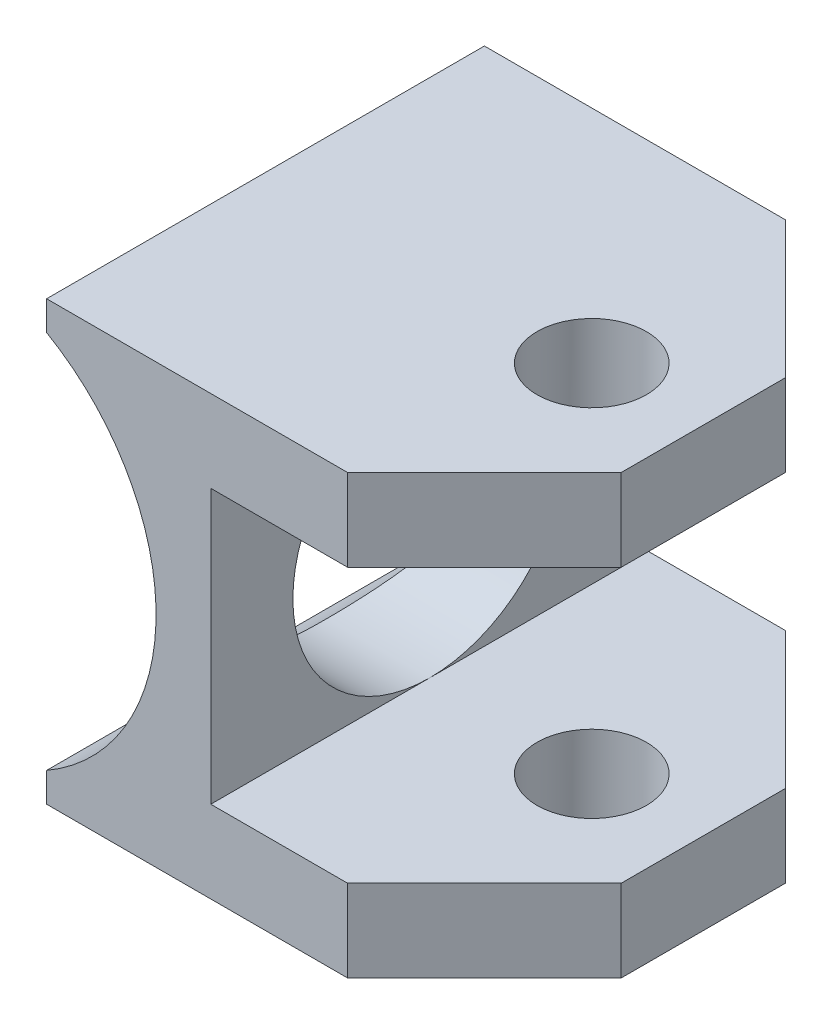
ISO-10303-21;
HEADER;
FILE_DESCRIPTION(('STEP AP214'),'2;1');
FILE_NAME('part.step','',(''),(''),'','','');
FILE_SCHEMA(('AUTOMOTIVE_DESIGN { 1 0 10303 214 1 1 1 1 }'));
ENDSEC;
DATA;
#1=APPLICATION_CONTEXT('core data for automotive mechanical design processes');
#2=APPLICATION_PROTOCOL_DEFINITION('international standard','automotive_design',2000,#1);
#3=PRODUCT_CONTEXT('',#1,'mechanical');
#4=PRODUCT('Part','Part','',(#3));
#5=PRODUCT_RELATED_PRODUCT_CATEGORY('part','',(#4));
#6=PRODUCT_DEFINITION_FORMATION('','',#4);
#7=PRODUCT_DEFINITION_CONTEXT('part definition',#1,'design');
#8=PRODUCT_DEFINITION('design','',#6,#7);
#9=PRODUCT_DEFINITION_SHAPE('','',#8);
#10=(LENGTH_UNIT() NAMED_UNIT(*) SI_UNIT(.MILLI.,.METRE.));
#11=(NAMED_UNIT(*) PLANE_ANGLE_UNIT() SI_UNIT($,.RADIAN.));
#12=(NAMED_UNIT(*) SI_UNIT($,.STERADIAN.) SOLID_ANGLE_UNIT());
#13=UNCERTAINTY_MEASURE_WITH_UNIT(LENGTH_MEASURE(1.E-05),#10,'distance_accuracy_value','');
#14=(GEOMETRIC_REPRESENTATION_CONTEXT(3) GLOBAL_UNCERTAINTY_ASSIGNED_CONTEXT((#13)) GLOBAL_UNIT_ASSIGNED_CONTEXT((#10,
#11,#12)) REPRESENTATION_CONTEXT('',''));
#15=CARTESIAN_POINT('',(0.,0.,0.));
#16=DIRECTION('',(0.,0.,1.));
#17=DIRECTION('',(1.,0.,0.));
#18=AXIS2_PLACEMENT_3D('',#15,#16,#17);
#19=CARTESIAN_POINT('',(15.875,7.9375,25.4));
#20=DIRECTION('',(-1.,0.,0.));
#21=DIRECTION('',(0.,-1.,0.));
#22=AXIS2_PLACEMENT_3D('',#19,#20,#21);
#23=PLANE('',#22);
#24=DIRECTION('',(0.,0.,-1.));
#25=VECTOR('',#24,1.);
#26=CARTESIAN_POINT('',(15.875,-7.9375,25.4));
#27=LINE('',#26,#25);
#28=CARTESIAN_POINT('',(15.875,-7.9375,25.4));
#29=VERTEX_POINT('',#28);
#30=CARTESIAN_POINT('',(15.875,-7.9375,12.7));
#31=VERTEX_POINT('',#30);
#32=EDGE_CURVE('E163',#29,#31,#27,.T.);
#33=ORIENTED_EDGE('',*,*,#32,.T.);
#34=CARTESIAN_POINT('',(15.875,0.,12.7));
#35=DIRECTION('',(1.,0.,0.));
#36=DIRECTION('',(0.,1.,0.));
#37=AXIS2_PLACEMENT_3D('',#34,#35,#36);
#38=CIRCLE('',#37,7.9375);
#39=CARTESIAN_POINT('',(15.875,7.9375,12.7));
#40=VERTEX_POINT('',#39);
#41=EDGE_CURVE('E56',#40,#31,#38,.T.);
#42=ORIENTED_EDGE('',*,*,#41,.F.);
#43=DIRECTION('',(0.,0.,-1.));
#44=VECTOR('',#43,1.);
#45=CARTESIAN_POINT('',(15.875,7.9375,25.4));
#46=LINE('',#45,#44);
#47=CARTESIAN_POINT('',(15.875,7.9375,25.4));
#48=VERTEX_POINT('',#47);
#49=EDGE_CURVE('E160',#48,#40,#46,.T.);
#50=ORIENTED_EDGE('',*,*,#49,.F.);
#51=DIRECTION('',(0.,1.,0.));
#52=VECTOR('',#51,1.);
#53=CARTESIAN_POINT('',(15.875,7.9375,25.4));
#54=LINE('',#53,#52);
#55=EDGE_CURVE('E231',#29,#48,#54,.T.);
#56=ORIENTED_EDGE('',*,*,#55,.F.);
#57=EDGE_LOOP('',(#33,#42,#50,#56));
#58=FACE_BOUND('',#57,.T.);
#59=ADVANCED_FACE('F36',(#58),#23,.F.);
#60=CARTESIAN_POINT('',(31.75,-7.93750000000001,25.4));
#61=DIRECTION('',(0.,-1.,0.));
#62=DIRECTION('',(1.,0.,0.));
#63=AXIS2_PLACEMENT_3D('',#60,#61,#62);
#64=PLANE('',#63);
#65=CARTESIAN_POINT('',(25.4,-7.9375,12.8217741924015));
#66=DIRECTION('',(0.,-1.,0.));
#67=DIRECTION('',(1.,0.,0.));
#68=AXIS2_PLACEMENT_3D('',#65,#66,#67);
#69=CIRCLE('',#68,3.175);
#70=CARTESIAN_POINT('',(28.575,-7.9375,12.8217741924015));
#71=VERTEX_POINT('',#70);
#72=EDGE_CURVE('E355',#71,#71,#69,.T.);
#73=ORIENTED_EDGE('',*,*,#72,.T.);
#74=EDGE_LOOP('',(#73));
#75=FACE_BOUND('',#74,.T.);
#76=DIRECTION('',(0.,0.,-1.));
#77=VECTOR('',#76,1.);
#78=CARTESIAN_POINT('',(31.75,-7.93750000000001,25.4));
#79=LINE('',#78,#77);
#80=CARTESIAN_POINT('',(31.75,-7.93750000000001,17.4625));
#81=VERTEX_POINT('',#80);
#82=CARTESIAN_POINT('',(31.75,-7.93750000000001,7.93750000000001));
#83=VERTEX_POINT('',#82);
#84=EDGE_CURVE('E240',#81,#83,#79,.T.);
#85=ORIENTED_EDGE('',*,*,#84,.T.);
#86=DIRECTION('',(0.707106781186548,0.,0.707106781186547));
#87=VECTOR('',#86,1.);
#88=CARTESIAN_POINT('',(31.75,-7.93750000000001,7.93750000000001));
#89=LINE('',#88,#87);
#90=CARTESIAN_POINT('',(23.8125,-7.9375,0.));
#91=VERTEX_POINT('',#90);
#92=EDGE_CURVE('E206',#83,#91,#89,.F.);
#93=ORIENTED_EDGE('',*,*,#92,.T.);
#94=DIRECTION('',(-1.,0.,0.));
#95=VECTOR('',#94,1.);
#96=CARTESIAN_POINT('',(31.75,-7.93750000000001,0.));
#97=LINE('',#96,#95);
#98=CARTESIAN_POINT('',(15.875,-7.9375,0.));
#99=VERTEX_POINT('',#98);
#100=EDGE_CURVE('E241',#91,#99,#97,.T.);
#101=ORIENTED_EDGE('',*,*,#100,.T.);
#102=EDGE_CURVE('E177',#31,#99,#27,.T.);
#103=ORIENTED_EDGE('',*,*,#102,.F.);
#104=ORIENTED_EDGE('',*,*,#32,.F.);
#105=DIRECTION('',(-1.,0.,0.));
#106=VECTOR('',#105,1.);
#107=CARTESIAN_POINT('',(31.75,-7.93750000000001,25.4));
#108=LINE('',#107,#106);
#109=CARTESIAN_POINT('',(23.8125,-7.9375,25.4));
#110=VERTEX_POINT('',#109);
#111=EDGE_CURVE('E259',#110,#29,#108,.T.);
#112=ORIENTED_EDGE('',*,*,#111,.F.);
#113=DIRECTION('',(0.707106781186546,0.,-0.707106781186549));
#114=VECTOR('',#113,1.);
#115=CARTESIAN_POINT('',(23.8125,-7.9375,25.4));
#116=LINE('',#115,#114);
#117=EDGE_CURVE('E204',#110,#81,#116,.T.);
#118=ORIENTED_EDGE('',*,*,#117,.T.);
#119=EDGE_LOOP('',(#85,#93,#101,#103,#104,#112,#118));
#120=FACE_BOUND('',#119,.T.);
#121=ADVANCED_FACE('F319',(#75,#120),#64,.F.);
#122=CARTESIAN_POINT('',(15.875,7.9375,0.));
#123=VERTEX_POINT('',#122);
#124=EDGE_CURVE('E165',#40,#123,#46,.T.);
#125=ORIENTED_EDGE('',*,*,#124,.F.);
#126=EDGE_CURVE('E148',#31,#40,#38,.T.);
#127=ORIENTED_EDGE('',*,*,#126,.F.);
#128=ORIENTED_EDGE('',*,*,#102,.T.);
#129=DIRECTION('',(0.,1.,0.));
#130=VECTOR('',#129,1.);
#131=CARTESIAN_POINT('',(15.875,7.9375,0.));
#132=LINE('',#131,#130);
#133=EDGE_CURVE('E168',#99,#123,#132,.T.);
#134=ORIENTED_EDGE('',*,*,#133,.T.);
#135=EDGE_LOOP('',(#125,#127,#128,#134));
#136=FACE_BOUND('',#135,.T.);
#137=ADVANCED_FACE('F166',(#136),#23,.F.);
#138=CARTESIAN_POINT('',(31.75,7.93750000000001,25.4));
#139=DIRECTION('',(0.,1.,0.));
#140=DIRECTION('',(-1.,0.,0.));
#141=AXIS2_PLACEMENT_3D('',#138,#139,#140);
#142=PLANE('',#141);
#143=CARTESIAN_POINT('',(25.4,7.9375,12.8217741924015));
#144=DIRECTION('',(0.,1.,0.));
#145=DIRECTION('',(-1.,0.,0.));
#146=AXIS2_PLACEMENT_3D('',#143,#144,#145);
#147=CIRCLE('',#146,3.175);
#148=CARTESIAN_POINT('',(22.225,7.9375,12.8217741924015));
#149=VERTEX_POINT('',#148);
#150=EDGE_CURVE('E244',#149,#149,#147,.T.);
#151=ORIENTED_EDGE('',*,*,#150,.T.);
#152=EDGE_LOOP('',(#151));
#153=FACE_BOUND('',#152,.T.);
#154=DIRECTION('',(1.,0.,0.));
#155=VECTOR('',#154,1.);
#156=CARTESIAN_POINT('',(31.75,7.93750000000001,0.));
#157=LINE('',#156,#155);
#158=CARTESIAN_POINT('',(23.8125,7.9375,0.));
#159=VERTEX_POINT('',#158);
#160=EDGE_CURVE('E246',#123,#159,#157,.T.);
#161=ORIENTED_EDGE('',*,*,#160,.T.);
#162=DIRECTION('',(-0.707106781186548,0.,-0.707106781186547));
#163=VECTOR('',#162,1.);
#164=CARTESIAN_POINT('',(31.75,7.93750000000001,7.93750000000001));
#165=LINE('',#164,#163);
#166=CARTESIAN_POINT('',(31.75,7.93750000000001,7.93750000000001));
#167=VERTEX_POINT('',#166);
#168=EDGE_CURVE('E197',#159,#167,#165,.F.);
#169=ORIENTED_EDGE('',*,*,#168,.T.);
#170=DIRECTION('',(0.,0.,-1.));
#171=VECTOR('',#170,1.);
#172=CARTESIAN_POINT('',(31.75,7.93750000000001,25.4));
#173=LINE('',#172,#171);
#174=CARTESIAN_POINT('',(31.75,7.93750000000001,17.4625));
#175=VERTEX_POINT('',#174);
#176=EDGE_CURVE('E172',#175,#167,#173,.T.);
#177=ORIENTED_EDGE('',*,*,#176,.F.);
#178=DIRECTION('',(-0.707106781186546,0.,0.707106781186549));
#179=VECTOR('',#178,1.);
#180=CARTESIAN_POINT('',(23.8125,7.9375,25.4));
#181=LINE('',#180,#179);
#182=CARTESIAN_POINT('',(23.8125,7.9375,25.4));
#183=VERTEX_POINT('',#182);
#184=EDGE_CURVE('E195',#175,#183,#181,.T.);
#185=ORIENTED_EDGE('',*,*,#184,.T.);
#186=DIRECTION('',(1.,0.,0.));
#187=VECTOR('',#186,1.);
#188=CARTESIAN_POINT('',(31.75,7.93750000000001,25.4));
#189=LINE('',#188,#187);
#190=EDGE_CURVE('E176',#48,#183,#189,.T.);
#191=ORIENTED_EDGE('',*,*,#190,.F.);
#192=ORIENTED_EDGE('',*,*,#49,.T.);
#193=ORIENTED_EDGE('',*,*,#124,.T.);
#194=EDGE_LOOP('',(#161,#169,#177,#185,#191,#192,#193));
#195=FACE_BOUND('',#194,.T.);
#196=ADVANCED_FACE('F174',(#153,#195),#142,.F.);
#197=CARTESIAN_POINT('',(31.75,12.7,25.4));
#198=DIRECTION('',(-1.,0.,0.));
#199=DIRECTION('',(0.,0.,1.));
#200=AXIS2_PLACEMENT_3D('',#197,#198,#199);
#201=PLANE('',#200);
#202=ORIENTED_EDGE('',*,*,#176,.T.);
#203=DIRECTION('',(0.,1.,0.));
#204=VECTOR('',#203,1.);
#205=CARTESIAN_POINT('',(31.75,12.7,7.93750000000001));
#206=LINE('',#205,#204);
#207=CARTESIAN_POINT('',(31.75,12.7,7.93750000000001));
#208=VERTEX_POINT('',#207);
#209=EDGE_CURVE('E184',#167,#208,#206,.T.);
#210=ORIENTED_EDGE('',*,*,#209,.T.);
#211=DIRECTION('',(0.,0.,-1.));
#212=VECTOR('',#211,1.);
#213=CARTESIAN_POINT('',(31.75,12.7,25.4));
#214=LINE('',#213,#212);
#215=CARTESIAN_POINT('',(31.75,12.7,17.4625));
#216=VERTEX_POINT('',#215);
#217=EDGE_CURVE('E274',#216,#208,#214,.T.);
#218=ORIENTED_EDGE('',*,*,#217,.F.);
#219=DIRECTION('',(0.,-1.,0.));
#220=VECTOR('',#219,1.);
#221=CARTESIAN_POINT('',(31.75,7.93750000000001,17.4625));
#222=LINE('',#221,#220);
#223=EDGE_CURVE('E182',#216,#175,#222,.T.);
#224=ORIENTED_EDGE('',*,*,#223,.T.);
#225=EDGE_LOOP('',(#202,#210,#218,#224));
#226=FACE_BOUND('',#225,.T.);
#227=ADVANCED_FACE('F279',(#226),#201,.F.);
#228=CARTESIAN_POINT('',(6.35,12.7,25.4));
#229=DIRECTION('',(0.,-1.,0.));
#230=DIRECTION('',(0.,0.,-1.));
#231=AXIS2_PLACEMENT_3D('',#228,#229,#230);
#232=PLANE('',#231);
#233=CARTESIAN_POINT('',(25.4,12.7,12.8217741924015));
#234=DIRECTION('',(0.,1.,0.));
#235=DIRECTION('',(0.,0.,1.));
#236=AXIS2_PLACEMENT_3D('',#233,#234,#235);
#237=CIRCLE('',#236,3.175);
#238=CARTESIAN_POINT('',(25.4,12.7,15.9967741924015));
#239=VERTEX_POINT('',#238);
#240=EDGE_CURVE('E349',#239,#239,#237,.T.);
#241=ORIENTED_EDGE('',*,*,#240,.F.);
#242=EDGE_LOOP('',(#241));
#243=FACE_BOUND('',#242,.T.);
#244=ORIENTED_EDGE('',*,*,#217,.T.);
#245=DIRECTION('',(0.707106781186548,0.,0.707106781186547));
#246=VECTOR('',#245,1.);
#247=CARTESIAN_POINT('',(31.75,12.7,7.93750000000001));
#248=LINE('',#247,#246);
#249=CARTESIAN_POINT('',(23.8125,12.7,0.));
#250=VERTEX_POINT('',#249);
#251=EDGE_CURVE('E189',#208,#250,#248,.F.);
#252=ORIENTED_EDGE('',*,*,#251,.T.);
#253=DIRECTION('',(-1.,0.,0.));
#254=VECTOR('',#253,1.);
#255=CARTESIAN_POINT('',(6.35,12.7,0.));
#256=LINE('',#255,#254);
#257=CARTESIAN_POINT('',(6.35,12.7,0.));
#258=VERTEX_POINT('',#257);
#259=EDGE_CURVE('E248',#250,#258,#256,.T.);
#260=ORIENTED_EDGE('',*,*,#259,.T.);
#261=DIRECTION('',(0.,0.,-1.));
#262=VECTOR('',#261,1.);
#263=CARTESIAN_POINT('',(6.35,12.7,25.4));
#264=LINE('',#263,#262);
#265=CARTESIAN_POINT('',(6.35,12.7,25.4));
#266=VERTEX_POINT('',#265);
#267=EDGE_CURVE('E225',#266,#258,#264,.T.);
#268=ORIENTED_EDGE('',*,*,#267,.F.);
#269=DIRECTION('',(-1.,0.,0.));
#270=VECTOR('',#269,1.);
#271=CARTESIAN_POINT('',(6.35,12.7,25.4));
#272=LINE('',#271,#270);
#273=CARTESIAN_POINT('',(23.8125,12.7,25.4));
#274=VERTEX_POINT('',#273);
#275=EDGE_CURVE('E216',#274,#266,#272,.T.);
#276=ORIENTED_EDGE('',*,*,#275,.F.);
#277=DIRECTION('',(0.707106781186546,0.,-0.707106781186549));
#278=VECTOR('',#277,1.);
#279=CARTESIAN_POINT('',(23.8125,12.7,25.4));
#280=LINE('',#279,#278);
#281=EDGE_CURVE('E187',#274,#216,#280,.T.);
#282=ORIENTED_EDGE('',*,*,#281,.T.);
#283=EDGE_LOOP('',(#244,#252,#260,#268,#276,#282));
#284=FACE_BOUND('',#283,.T.);
#285=ADVANCED_FACE('F222',(#243,#284),#232,.F.);
#286=CARTESIAN_POINT('',(6.35,12.7,25.4));
#287=DIRECTION('',(1.,0.,0.));
#288=DIRECTION('',(0.,0.,-1.));
#289=AXIS2_PLACEMENT_3D('',#286,#287,#288);
#290=PLANE('',#289);
#291=DIRECTION('',(0.,-1.,0.));
#292=VECTOR('',#291,1.);
#293=CARTESIAN_POINT('',(6.35,12.7,0.));
#294=LINE('',#293,#292);
#295=CARTESIAN_POINT('',(6.35,10.9985226280624,0.));
#296=VERTEX_POINT('',#295);
#297=EDGE_CURVE('E250',#258,#296,#294,.T.);
#298=ORIENTED_EDGE('',*,*,#297,.T.);
#299=DIRECTION('',(0.,0.,-1.));
#300=VECTOR('',#299,1.);
#301=CARTESIAN_POINT('',(6.35,10.9985226280624,25.4));
#302=LINE('',#301,#300);
#303=CARTESIAN_POINT('',(6.35,10.9985226280624,25.4));
#304=VERTEX_POINT('',#303);
#305=EDGE_CURVE('E271',#304,#296,#302,.T.);
#306=ORIENTED_EDGE('',*,*,#305,.F.);
#307=DIRECTION('',(0.,-1.,0.));
#308=VECTOR('',#307,1.);
#309=CARTESIAN_POINT('',(6.35,12.7,25.4));
#310=LINE('',#309,#308);
#311=EDGE_CURVE('E227',#266,#304,#310,.T.);
#312=ORIENTED_EDGE('',*,*,#311,.F.);
#313=ORIENTED_EDGE('',*,*,#267,.T.);
#314=EDGE_LOOP('',(#298,#306,#312,#313));
#315=FACE_BOUND('',#314,.T.);
#316=ADVANCED_FACE('F293',(#315),#290,.F.);
#317=CARTESIAN_POINT('',(0.,0.,25.4));
#318=DIRECTION('',(0.,0.,-1.));
#319=DIRECTION('',(-1.,0.,0.));
#320=AXIS2_PLACEMENT_3D('',#317,#318,#319);
#321=CYLINDRICAL_SURFACE('',#320,12.7);
#322=CARTESIAN_POINT('',(9.91393432245746,7.93749999999999,12.7));
#323=CARTESIAN_POINT('',(9.91393743092308,7.93749807117173,12.8973419473668));
#324=CARTESIAN_POINT('',(9.91985215824847,7.93012603335574,13.0947215209105));
#325=CARTESIAN_POINT('',(9.94324673536641,7.90077104762888,13.4877854127054));
#326=CARTESIAN_POINT('',(9.96073339680289,7.87877949412646,13.6834686636694));
#327=CARTESIAN_POINT('',(10.0065324338063,7.82052925594829,14.0718083760823));
#328=CARTESIAN_POINT('',(10.0348666437677,7.78424179156469,14.2644579115298));
#329=CARTESIAN_POINT('',(10.101195001923,7.69797450385109,14.645043990796));
#330=CARTESIAN_POINT('',(10.1391939786885,7.64798783535172,14.8329781270604));
#331=CARTESIAN_POINT('',(10.2230420608463,7.53553428680958,15.2012730518735));
#332=CARTESIAN_POINT('',(10.2688158617562,7.47318624722427,15.3816875444356));
#333=CARTESIAN_POINT('',(10.3670018650817,7.33637238040691,15.7360566142668));
#334=CARTESIAN_POINT('',(10.4194165927314,7.26190194050868,15.9100087014738));
#335=CARTESIAN_POINT('',(10.5293900056247,7.10150650275365,16.2507695742633));
#336=CARTESIAN_POINT('',(10.5869470535524,7.01558514661686,16.4175806087131));
#337=CARTESIAN_POINT('',(10.7058168021436,6.8328157497932,16.7436961942778));
#338=CARTESIAN_POINT('',(10.7671296214479,6.7359673638515,16.9030005079817));
#339=CARTESIAN_POINT('',(10.9005856580608,6.51810262210699,17.2346122324182));
#340=CARTESIAN_POINT('',(10.9730780959916,6.39558712833621,17.4057956613673));
#341=CARTESIAN_POINT('',(11.1193961406205,6.13767190932958,17.7375632510214));
#342=CARTESIAN_POINT('',(11.1932218447478,6.00227123938997,17.8981466330976));
#343=CARTESIAN_POINT('',(11.3405793525838,5.71898311367739,18.2082916826293));
#344=CARTESIAN_POINT('',(11.4141108977764,5.57108647346249,18.3578450892493));
#345=CARTESIAN_POINT('',(11.5592442814053,5.26334714419427,18.6452007689191));
#346=CARTESIAN_POINT('',(11.6308457432919,5.10350214670036,18.7830007601235));
#347=CARTESIAN_POINT('',(11.7790512355257,4.75231816673879,19.062041829267));
#348=CARTESIAN_POINT('',(11.8552106939563,4.55950961778765,19.2016779504539));
#349=CARTESIAN_POINT('',(12.0010624927184,4.16048061480433,19.4639692392614));
#350=CARTESIAN_POINT('',(12.0707577505083,3.9542662833262,19.586632079773));
#351=CARTESIAN_POINT('',(12.2017054249088,3.52955168731285,19.8136569756096));
#352=CARTESIAN_POINT('',(12.2629618345875,3.31105730280366,19.918027692753));
#353=CARTESIAN_POINT('',(12.3751940579834,2.86318550306455,20.1070996839522));
#354=CARTESIAN_POINT('',(12.4261717410597,2.63381007612534,20.1918045350015));
#355=CARTESIAN_POINT('',(12.5116072321274,2.18985682334513,20.3326287607597));
#356=CARTESIAN_POINT('',(12.5472173985435,1.97614412570738,20.3907783430431));
#357=CARTESIAN_POINT('',(12.6077929385108,1.54315338166047,20.4892142298474));
#358=CARTESIAN_POINT('',(12.632758967362,1.32387567873837,20.5295016340485));
#359=CARTESIAN_POINT('',(12.6712823156172,0.881910980169238,20.5915075654516));
#360=CARTESIAN_POINT('',(12.6848496264323,0.659227144852406,20.6132423549958));
#361=CARTESIAN_POINT('',(12.700189771581,0.212423453759177,20.637809668065));
#362=CARTESIAN_POINT('',(12.7019639634905,-0.011696233754465,20.6406443672919));
#363=CARTESIAN_POINT('',(12.6942296634621,-0.429035223888257,20.6282648350536));
#364=CARTESIAN_POINT('',(12.6862058663109,-0.62235823312776,20.6154257355186));
#365=CARTESIAN_POINT('',(12.6614801835746,-1.00700112464608,20.575736763912));
#366=CARTESIAN_POINT('',(12.6447783901897,-1.19832102818506,20.5488870406977));
#367=CARTESIAN_POINT('',(12.6030772135313,-1.57760898199506,20.4815268240343));
#368=CARTESIAN_POINT('',(12.5780779198634,-1.76557706843963,20.4410164781077));
#369=CARTESIAN_POINT('',(12.5203318918918,-2.13696376055922,20.3468293775869));
#370=CARTESIAN_POINT('',(12.4875848313309,-2.32038217428876,20.2931520685303));
#371=CARTESIAN_POINT('',(12.4149421348142,-2.68203232637647,20.1730841675945));
#372=CARTESIAN_POINT('',(12.3750303286643,-2.86025124976266,20.1066647942266));
#373=CARTESIAN_POINT('',(12.288903070966,-3.21020089927347,19.9618469139278));
#374=CARTESIAN_POINT('',(12.2426855288447,-3.3819294493971,19.8834444331348));
#375=CARTESIAN_POINT('',(12.095872474436,-3.88614684054671,19.6312926139097));
#376=CARTESIAN_POINT('',(11.9870644777299,-4.20791741807511,19.4405148403145));
#377=CARTESIAN_POINT('',(11.7407146973701,-4.8559779367887,18.9926593049406));
#378=CARTESIAN_POINT('',(11.6012821960077,-5.1778470367181,18.7302852986395));
#379=CARTESIAN_POINT('',(11.3153894233701,-5.77597246713827,18.160122153886));
#380=CARTESIAN_POINT('',(11.1689191509646,-6.05216125105313,17.85226701367));
#381=CARTESIAN_POINT('',(10.9442052242841,-6.44525099752128,17.3386711320003));
#382=CARTESIAN_POINT('',(10.863953416429,-6.57924242421982,17.1466373385129));
#383=CARTESIAN_POINT('',(10.7077668255894,-6.83048858697236,16.7501114043343));
#384=CARTESIAN_POINT('',(10.6318328552849,-6.94774017857745,16.5456169332671));
#385=CARTESIAN_POINT('',(10.4871369448416,-7.16428003695993,16.1253190811957));
#386=CARTESIAN_POINT('',(10.4183644230893,-7.26359497075574,15.9095331140881));
#387=CARTESIAN_POINT('',(10.2907680692678,-7.4432684407942,15.4674053699895));
#388=CARTESIAN_POINT('',(10.2319399940845,-7.52363506774175,15.2410681478863));
#389=CARTESIAN_POINT('',(10.1409356021058,-7.64562571774624,14.840082345974));
#390=CARTESIAN_POINT('',(10.1058190992332,-7.69188004525148,14.6674974829339));
#391=CARTESIAN_POINT('',(10.0436676197095,-7.77286000991658,14.3182297843453));
#392=CARTESIAN_POINT('',(10.0166306889123,-7.80758843498593,14.1415479508588));
#393=CARTESIAN_POINT('',(9.97159914754477,-7.86502040955978,13.7852993043909));
#394=CARTESIAN_POINT('',(9.9535943493274,-7.88773750861337,13.6057359786318));
#395=CARTESIAN_POINT('',(9.92725853225642,-7.92085789749513,13.2447592078086));
#396=CARTESIAN_POINT('',(9.91892766668002,-7.93126099221591,13.0633457334762));
#397=CARTESIAN_POINT('',(9.91226303596064,-7.93958886915166,12.699627886823));
#398=CARTESIAN_POINT('',(9.91395234775775,-7.93748484686335,12.5173224248947));
#399=CARTESIAN_POINT('',(9.92731384781059,-7.92076713027602,12.1536582134984));
#400=CARTESIAN_POINT('',(9.93898609289779,-7.90615336476078,11.9722994694258));
#401=CARTESIAN_POINT('',(9.97186350946095,-7.86464458928345,11.6117828822214));
#402=CARTESIAN_POINT('',(9.99307362080675,-7.83774321518591,11.4326262290601));
#403=CARTESIAN_POINT('',(10.0442534502941,-7.77204614469582,11.0777196131951));
#404=CARTESIAN_POINT('',(10.0742267851106,-7.73324553703941,10.9019710890601));
#405=CARTESIAN_POINT('',(10.1413407941711,-7.64501277058946,10.5578759134273));
#406=CARTESIAN_POINT('',(10.1783507843565,-7.59577281991966,10.3894541906629));
#407=CARTESIAN_POINT('',(10.2587766080083,-7.48679406868883,10.0575869903785));
#408=CARTESIAN_POINT('',(10.3021945286435,-7.42705184614786,9.89414315524309));
#409=CARTESIAN_POINT('',(10.4403538304839,-7.23285940874745,9.41220711452345));
#410=CARTESIAN_POINT('',(10.5430357226203,-7.08339933513072,9.10194110865951));
#411=CARTESIAN_POINT('',(10.781510951545,-6.71606056449941,8.4498234680742));
#412=CARTESIAN_POINT('',(10.9198863364876,-6.49057334557518,8.11320473830511));
#413=CARTESIAN_POINT('',(11.1306963245213,-6.11704111107704,7.63774622437057));
#414=CARTESIAN_POINT('',(11.2015652952635,-5.98652858081219,7.48406086270945));
#415=CARTESIAN_POINT('',(11.3429763006025,-5.71405449107206,7.18691398237368));
#416=CARTESIAN_POINT('',(11.4135182725577,-5.57209082661585,7.04345435259447));
#417=CARTESIAN_POINT('',(11.5640372459169,-5.2534636765396,6.74516975727459));
#418=CARTESIAN_POINT('',(11.6437082552696,-5.07489047419139,6.59222444225079));
#419=CARTESIAN_POINT('',(11.7985367210445,-4.70371630182141,6.30199791161703));
#420=CARTESIAN_POINT('',(11.8736958712464,-4.51112065675944,6.16471080018115));
#421=CARTESIAN_POINT('',(12.0175099931568,-4.11269997828182,5.90692310882832));
#422=CARTESIAN_POINT('',(12.0861652819097,-3.9068755905506,5.78642171052195));
#423=CARTESIAN_POINT('',(12.215028128029,-3.48311756629154,5.56353821312848));
#424=CARTESIAN_POINT('',(12.2752367509349,-3.26518546199252,5.46115382816924));
#425=CARTESIAN_POINT('',(12.3821073364553,-2.83199177980674,5.28141588628359));
#426=CARTESIAN_POINT('',(12.4293629720927,-2.61734576396781,5.20293385002475));
#427=CARTESIAN_POINT('',(12.5134440839727,-2.18019278875926,5.06434501873419));
#428=CARTESIAN_POINT('',(12.5502698053864,-1.95768601430726,5.00423779177151));
#429=CARTESIAN_POINT('',(12.6123219175109,-1.50698970812904,4.90345291578128));
#430=CARTESIAN_POINT('',(12.6375616318848,-1.27880702366645,4.86275294671762));
#431=CARTESIAN_POINT('',(12.6756810572711,-0.818749786145594,4.80143183963765));
#432=CARTESIAN_POINT('',(12.688562812949,-0.586875850273308,4.78080738005311));
#433=CARTESIAN_POINT('',(12.7005867596475,-0.156261293647302,4.76155892461821));
#434=CARTESIAN_POINT('',(12.70147806193,0.0423118825154984,4.76013411291166));
#435=CARTESIAN_POINT('',(12.6939644931375,0.438829919383832,4.77215881998338));
#436=CARTESIAN_POINT('',(12.685560050359,0.636774808615952,4.78560765346638));
#437=CARTESIAN_POINT('',(12.6596609571081,1.03049004439692,4.82718699179976));
#438=CARTESIAN_POINT('',(12.6421670478776,1.22626056693495,4.85531629946479));
#439=CARTESIAN_POINT('',(12.598507705164,1.61422143641658,4.92587174223497));
#440=CARTESIAN_POINT('',(12.5723420911155,1.80641170872293,4.96829817504016));
#441=CARTESIAN_POINT('',(12.5129997291544,2.17927146967088,5.06517973090754));
#442=CARTESIAN_POINT('',(12.4801004774043,2.36010874093628,5.11916178651719));
#443=CARTESIAN_POINT('',(12.4074472588691,2.71630413457792,5.23937361310624));
#444=CARTESIAN_POINT('',(12.3676910756804,2.89166046360292,5.30560734476566));
#445=CARTESIAN_POINT('',(12.2821039617717,3.23594956191219,5.4496659460595));
#446=CARTESIAN_POINT('',(12.2362747015826,3.40488408126802,5.52748762890358));
#447=CARTESIAN_POINT('',(12.1393647800458,3.73571812716443,5.69409831573719));
#448=CARTESIAN_POINT('',(12.0882822147684,3.89761507265321,5.78289129836725));
#449=CARTESIAN_POINT('',(11.9174367352839,4.40453137082998,6.08422041738119));
#450=CARTESIAN_POINT('',(11.789125336336,4.73498961253622,6.3168741254543));
#451=CARTESIAN_POINT('',(11.5210034521921,5.35450474789467,6.82679162091428));
#452=CARTESIAN_POINT('',(11.38118007982,5.64351422152492,7.10410574499164));
#453=CARTESIAN_POINT('',(11.1609311335306,6.06245469084998,7.57138443198061));
#454=CARTESIAN_POINT('',(11.0806664160962,6.20757371147303,7.74801049072365));
#455=CARTESIAN_POINT('',(10.9221411305204,6.48244047607236,8.11368961161338));
#456=CARTESIAN_POINT('',(10.8438809280521,6.61218543087358,8.3027449190405));
#457=CARTESIAN_POINT('',(10.6156799834555,6.97705598554874,8.88746806028404));
#458=CARTESIAN_POINT('',(10.4720667600113,7.18827539875168,9.30120253140835));
#459=CARTESIAN_POINT('',(10.2507773072005,7.49932946637276,10.0737985118251));
#460=CARTESIAN_POINT('',(10.1655461083059,7.61344381460759,10.4247206322575));
#461=CARTESIAN_POINT('',(10.0631440576819,7.74765800298494,10.9644717705398));
#462=CARTESIAN_POINT('',(10.0332681346926,7.78621624163261,11.1464271212424));
#463=CARTESIAN_POINT('',(9.98298925565334,7.85058138682066,11.5138311056077));
#464=CARTESIAN_POINT('',(9.96258142541109,7.87639485483383,11.6992778905913));
#465=CARTESIAN_POINT('',(9.93626716627901,7.90954454493815,12.0207163673922));
#466=CARTESIAN_POINT('',(9.9279108380348,7.92001686347467,12.1561965252872));
#467=CARTESIAN_POINT('',(9.91674264691122,7.9339961320438,12.427778389774));
#468=CARTESIAN_POINT('',(9.91393217834371,7.93750133044005,12.5638802440509));
#469=CARTESIAN_POINT('',(9.91393432245746,7.93749999999999,12.7));
#470=B_SPLINE_CURVE_WITH_KNOTS('',3,(#322,#323,#324,#325,#326,#327,#328,#329,#330,#331,#332,
#333,#334,#335,#336,#337,#338,#339,#340,#341,#342,#343,#344,#345,#346,#347,#348,#349,#350,#351,
#352,#353,#354,#355,#356,#357,#358,#359,#360,#361,#362,#363,#364,#365,#366,#367,#368,#369,#370,
#371,#372,#373,#374,#375,#376,#377,#378,#379,#380,#381,#382,#383,#384,#385,#386,#387,#388,#389,
#390,#391,#392,#393,#394,#395,#396,#397,#398,#399,#400,#401,#402,#403,#404,#405,#406,#407,#408,
#409,#410,#411,#412,#413,#414,#415,#416,#417,#418,#419,#420,#421,#422,#423,#424,#425,#426,#427,
#428,#429,#430,#431,#432,#433,#434,#435,#436,#437,#438,#439,#440,#441,#442,#443,#444,#445,#446,
#447,#448,#449,#450,#451,#452,#453,#454,#455,#456,#457,#458,#459,#460,#461,#462,#463,#464,#465,
#466,#467,#468,#469),.UNSPECIFIED.,.T.,.F.,(4,2,2,2,2,2,2,2,2,2,2,2,2,2,2,2,2,2,2,2,2,2,2,2,2,2,
2,2,2,2,2,2,2,2,2,2,2,2,2,2,2,2,2,2,2,2,2,2,2,2,2,2,2,2,2,2,2,2,2,2,2,2,2,2,2,2,2,2,2,2,2,2,2,
4),(0.,0.591868627851358,1.18408596048253,1.77750165380366,2.37121440529117,2.95947423182983,
3.54795842122594,4.13625590039149,4.72457197284976,5.39183974714808,6.05915648133166,
6.72696802742672,7.39490893086401,8.14375547254982,8.89226237916849,9.64041388408815,
10.3884292021125,11.06042681852,11.7323830578222,12.4037496855178,13.0750390268694,
13.6560853409466,14.2371254817675,14.8181593480741,15.3992176859833,15.9816042967208,
16.5641844604029,17.7285465780936,19.0378098157476,20.3489920539132,21.090817692213,
21.8327824939127,22.5736349446533,23.3141704848642,23.8599197831255,24.405536978029,
24.9505373613146,25.4955463796607,26.0418110660364,26.5880788622416,27.134629908943,
27.68140684223,28.2188767470207,28.7565221025905,29.8312827257654,31.1106653030828,
31.7513794571451,32.392211658741,33.1360493525192,33.8796060359229,34.6231264544351,
35.3665529939868,36.0656523145943,36.7647352004268,37.4630121292216,38.1611735058357,
38.7561604440118,39.3511199696233,39.9460309841615,40.5409543869227,41.1150518645325,
41.6893352598014,42.2634610126861,42.8377955814166,44.1046058539166,45.3728540698994,
46.0989299661152,46.8251373865625,48.2753879889853,49.4067352744844,49.9712745352798,
50.5355228468086,50.9436710721342,51.3519218989456),.UNSPECIFIED.);
#471=CARTESIAN_POINT('',(9.91393432245746,7.93749999999999,12.7));
#472=VERTEX_POINT('',#471);
#473=EDGE_CURVE('E40',#472,#472,#470,.T.);
#474=ORIENTED_EDGE('',*,*,#473,.T.);
#475=EDGE_LOOP('',(#474));
#476=FACE_BOUND('',#475,.T.);
#477=CARTESIAN_POINT('',(0.,0.,0.));
#478=DIRECTION('',(0.,0.,-1.));
#479=DIRECTION('',(1.,0.,0.));
#480=AXIS2_PLACEMENT_3D('',#477,#478,#479);
#481=CIRCLE('',#480,12.7);
#482=CARTESIAN_POINT('',(6.34999999999999,-10.9985226280624,0.));
#483=VERTEX_POINT('',#482);
#484=EDGE_CURVE('E252',#296,#483,#481,.T.);
#485=ORIENTED_EDGE('',*,*,#484,.T.);
#486=DIRECTION('',(0.,0.,-1.));
#487=VECTOR('',#486,1.);
#488=CARTESIAN_POINT('',(6.34999999999999,-10.9985226280624,25.4));
#489=LINE('',#488,#487);
#490=CARTESIAN_POINT('',(6.34999999999999,-10.9985226280624,25.4));
#491=VERTEX_POINT('',#490);
#492=EDGE_CURVE('E268',#491,#483,#489,.T.);
#493=ORIENTED_EDGE('',*,*,#492,.F.);
#494=CARTESIAN_POINT('',(0.,0.,25.4));
#495=DIRECTION('',(0.,0.,-1.));
#496=DIRECTION('',(1.,0.,0.));
#497=AXIS2_PLACEMENT_3D('',#494,#495,#496);
#498=CIRCLE('',#497,12.7);
#499=EDGE_CURVE('E229',#304,#491,#498,.T.);
#500=ORIENTED_EDGE('',*,*,#499,.F.);
#501=ORIENTED_EDGE('',*,*,#305,.T.);
#502=EDGE_LOOP('',(#485,#493,#500,#501));
#503=FACE_BOUND('',#502,.T.);
#504=ADVANCED_FACE('F296',(#476,#503),#321,.F.);
#505=CARTESIAN_POINT('',(6.34999999999999,-12.7,25.4));
#506=DIRECTION('',(1.,0.,0.));
#507=DIRECTION('',(0.,0.,-1.));
#508=AXIS2_PLACEMENT_3D('',#505,#506,#507);
#509=PLANE('',#508);
#510=DIRECTION('',(0.,-1.,0.));
#511=VECTOR('',#510,1.);
#512=CARTESIAN_POINT('',(6.34999999999999,-12.7,0.));
#513=LINE('',#512,#511);
#514=CARTESIAN_POINT('',(6.34999999999999,-12.7,0.));
#515=VERTEX_POINT('',#514);
#516=EDGE_CURVE('E254',#483,#515,#513,.T.);
#517=ORIENTED_EDGE('',*,*,#516,.T.);
#518=DIRECTION('',(0.,0.,-1.));
#519=VECTOR('',#518,1.);
#520=CARTESIAN_POINT('',(6.34999999999999,-12.7,25.4));
#521=LINE('',#520,#519);
#522=CARTESIAN_POINT('',(6.34999999999999,-12.7,25.4));
#523=VERTEX_POINT('',#522);
#524=EDGE_CURVE('E265',#523,#515,#521,.T.);
#525=ORIENTED_EDGE('',*,*,#524,.F.);
#526=DIRECTION('',(0.,-1.,0.));
#527=VECTOR('',#526,1.);
#528=CARTESIAN_POINT('',(6.34999999999999,-12.7,25.4));
#529=LINE('',#528,#527);
#530=EDGE_CURVE('E236',#491,#523,#529,.T.);
#531=ORIENTED_EDGE('',*,*,#530,.F.);
#532=ORIENTED_EDGE('',*,*,#492,.T.);
#533=EDGE_LOOP('',(#517,#525,#531,#532));
#534=FACE_BOUND('',#533,.T.);
#535=ADVANCED_FACE('F302',(#534),#509,.F.);
#536=CARTESIAN_POINT('',(6.34999999999999,-12.7,25.4));
#537=DIRECTION('',(0.,1.,0.));
#538=DIRECTION('',(0.,0.,1.));
#539=AXIS2_PLACEMENT_3D('',#536,#537,#538);
#540=PLANE('',#539);
#541=CARTESIAN_POINT('',(25.4,-12.7,12.8217741924015));
#542=DIRECTION('',(0.,1.,0.));
#543=DIRECTION('',(0.,0.,1.));
#544=AXIS2_PLACEMENT_3D('',#541,#542,#543);
#545=CIRCLE('',#544,3.17499999999999);
#546=CARTESIAN_POINT('',(25.4,-12.7,15.9967741924015));
#547=VERTEX_POINT('',#546);
#548=EDGE_CURVE('E351',#547,#547,#545,.T.);
#549=ORIENTED_EDGE('',*,*,#548,.T.);
#550=EDGE_LOOP('',(#549));
#551=FACE_BOUND('',#550,.T.);
#552=DIRECTION('',(1.,0.,0.));
#553=VECTOR('',#552,1.);
#554=CARTESIAN_POINT('',(6.34999999999999,-12.7,0.));
#555=LINE('',#554,#553);
#556=CARTESIAN_POINT('',(23.8125,-12.7,0.));
#557=VERTEX_POINT('',#556);
#558=EDGE_CURVE('E256',#515,#557,#555,.T.);
#559=ORIENTED_EDGE('',*,*,#558,.T.);
#560=DIRECTION('',(-0.707106781186548,0.,-0.707106781186547));
#561=VECTOR('',#560,1.);
#562=CARTESIAN_POINT('',(31.75,-12.7,7.93750000000001));
#563=LINE('',#562,#561);
#564=CARTESIAN_POINT('',(31.75,-12.7,7.93750000000001));
#565=VERTEX_POINT('',#564);
#566=EDGE_CURVE('E209',#557,#565,#563,.F.);
#567=ORIENTED_EDGE('',*,*,#566,.T.);
#568=DIRECTION('',(0.,0.,-1.));
#569=VECTOR('',#568,1.);
#570=CARTESIAN_POINT('',(31.75,-12.7,25.4));
#571=LINE('',#570,#569);
#572=CARTESIAN_POINT('',(31.75,-12.7,17.4625));
#573=VERTEX_POINT('',#572);
#574=EDGE_CURVE('E262',#573,#565,#571,.T.);
#575=ORIENTED_EDGE('',*,*,#574,.F.);
#576=DIRECTION('',(-0.707106781186546,0.,0.707106781186549));
#577=VECTOR('',#576,1.);
#578=CARTESIAN_POINT('',(23.8125,-12.7,25.4));
#579=LINE('',#578,#577);
#580=CARTESIAN_POINT('',(23.8125,-12.7,25.4));
#581=VERTEX_POINT('',#580);
#582=EDGE_CURVE('E64',#573,#581,#579,.T.);
#583=ORIENTED_EDGE('',*,*,#582,.T.);
#584=DIRECTION('',(1.,0.,0.));
#585=VECTOR('',#584,1.);
#586=CARTESIAN_POINT('',(6.34999999999999,-12.7,25.4));
#587=LINE('',#586,#585);
#588=EDGE_CURVE('E238',#523,#581,#587,.T.);
#589=ORIENTED_EDGE('',*,*,#588,.F.);
#590=ORIENTED_EDGE('',*,*,#524,.T.);
#591=EDGE_LOOP('',(#559,#567,#575,#583,#589,#590));
#592=FACE_BOUND('',#591,.T.);
#593=ADVANCED_FACE('F304',(#551,#592),#540,.F.);
#594=CARTESIAN_POINT('',(31.75,-12.7,25.4));
#595=DIRECTION('',(-1.,0.,0.));
#596=DIRECTION('',(0.,0.,1.));
#597=AXIS2_PLACEMENT_3D('',#594,#595,#596);
#598=PLANE('',#597);
#599=ORIENTED_EDGE('',*,*,#574,.T.);
#600=DIRECTION('',(0.,1.,0.));
#601=VECTOR('',#600,1.);
#602=CARTESIAN_POINT('',(31.75,-12.7,7.93750000000001));
#603=LINE('',#602,#601);
#604=EDGE_CURVE('E201',#565,#83,#603,.T.);
#605=ORIENTED_EDGE('',*,*,#604,.T.);
#606=ORIENTED_EDGE('',*,*,#84,.F.);
#607=DIRECTION('',(0.,-1.,0.));
#608=VECTOR('',#607,1.);
#609=CARTESIAN_POINT('',(31.75,-12.7,17.4625));
#610=LINE('',#609,#608);
#611=EDGE_CURVE('E199',#81,#573,#610,.T.);
#612=ORIENTED_EDGE('',*,*,#611,.T.);
#613=EDGE_LOOP('',(#599,#605,#606,#612));
#614=FACE_BOUND('',#613,.T.);
#615=ADVANCED_FACE('F307',(#614),#598,.F.);
#616=CARTESIAN_POINT('',(0.,0.,25.4));
#617=DIRECTION('',(0.,0.,1.));
#618=DIRECTION('',(1.,0.,0.));
#619=AXIS2_PLACEMENT_3D('',#616,#617,#618);
#620=PLANE('',#619);
#621=ORIENTED_EDGE('',*,*,#588,.T.);
#622=DIRECTION('',(0.,1.,0.));
#623=VECTOR('',#622,1.);
#624=CARTESIAN_POINT('',(23.8125,-7.93750000000001,25.4));
#625=LINE('',#624,#623);
#626=EDGE_CURVE('E11',#581,#110,#625,.T.);
#627=ORIENTED_EDGE('',*,*,#626,.T.);
#628=ORIENTED_EDGE('',*,*,#111,.T.);
#629=ORIENTED_EDGE('',*,*,#55,.T.);
#630=ORIENTED_EDGE('',*,*,#190,.T.);
#631=DIRECTION('',(0.,1.,0.));
#632=VECTOR('',#631,1.);
#633=CARTESIAN_POINT('',(23.8125,12.7,25.4));
#634=LINE('',#633,#632);
#635=EDGE_CURVE('E50',#183,#274,#634,.T.);
#636=ORIENTED_EDGE('',*,*,#635,.T.);
#637=ORIENTED_EDGE('',*,*,#275,.T.);
#638=ORIENTED_EDGE('',*,*,#311,.T.);
#639=ORIENTED_EDGE('',*,*,#499,.T.);
#640=ORIENTED_EDGE('',*,*,#530,.T.);
#641=EDGE_LOOP('',(#621,#627,#628,#629,#630,#636,#637,#638,#639,#640));
#642=FACE_BOUND('',#641,.T.);
#643=ADVANCED_FACE('F215',(#642),#620,.T.);
#644=CARTESIAN_POINT('',(0.,0.,0.));
#645=DIRECTION('',(0.,0.,1.));
#646=DIRECTION('',(1.,0.,0.));
#647=AXIS2_PLACEMENT_3D('',#644,#645,#646);
#648=PLANE('',#647);
#649=ORIENTED_EDGE('',*,*,#259,.F.);
#650=DIRECTION('',(0.,-1.,0.));
#651=VECTOR('',#650,1.);
#652=CARTESIAN_POINT('',(23.8125,0.,0.));
#653=LINE('',#652,#651);
#654=EDGE_CURVE('E193',#250,#159,#653,.T.);
#655=ORIENTED_EDGE('',*,*,#654,.T.);
#656=ORIENTED_EDGE('',*,*,#160,.F.);
#657=ORIENTED_EDGE('',*,*,#133,.F.);
#658=ORIENTED_EDGE('',*,*,#100,.F.);
#659=DIRECTION('',(0.,-1.,0.));
#660=VECTOR('',#659,1.);
#661=CARTESIAN_POINT('',(23.8125,0.,0.));
#662=LINE('',#661,#660);
#663=EDGE_CURVE('E191',#91,#557,#662,.T.);
#664=ORIENTED_EDGE('',*,*,#663,.T.);
#665=ORIENTED_EDGE('',*,*,#558,.F.);
#666=ORIENTED_EDGE('',*,*,#516,.F.);
#667=ORIENTED_EDGE('',*,*,#484,.F.);
#668=ORIENTED_EDGE('',*,*,#297,.F.);
#669=EDGE_LOOP('',(#649,#655,#656,#657,#658,#664,#665,#666,#667,#668));
#670=FACE_BOUND('',#669,.T.);
#671=ADVANCED_FACE('F288',(#670),#648,.F.);
#672=CARTESIAN_POINT('',(25.4,12.7,12.8217741924015));
#673=DIRECTION('',(0.,1.,0.));
#674=DIRECTION('',(0.,0.,1.));
#675=AXIS2_PLACEMENT_3D('',#672,#673,#674);
#676=CYLINDRICAL_SURFACE('',#675,3.175);
#677=ORIENTED_EDGE('',*,*,#240,.T.);
#678=EDGE_LOOP('',(#677));
#679=FACE_BOUND('',#678,.T.);
#680=ORIENTED_EDGE('',*,*,#150,.F.);
#681=EDGE_LOOP('',(#680));
#682=FACE_BOUND('',#681,.T.);
#683=ADVANCED_FACE('F384',(#679,#682),#676,.F.);
#684=ORIENTED_EDGE('',*,*,#548,.F.);
#685=EDGE_LOOP('',(#684));
#686=FACE_BOUND('',#685,.T.);
#687=ORIENTED_EDGE('',*,*,#72,.F.);
#688=EDGE_LOOP('',(#687));
#689=FACE_BOUND('',#688,.T.);
#690=ADVANCED_FACE('F380',(#686,#689),#676,.F.);
#691=CARTESIAN_POINT('',(31.75,12.7,7.93750000000001));
#692=DIRECTION('',(-0.707106781186547,0.,0.707106781186548));
#693=DIRECTION('',(0.,1.,0.));
#694=AXIS2_PLACEMENT_3D('',#691,#692,#693);
#695=PLANE('',#694);
#696=ORIENTED_EDGE('',*,*,#168,.F.);
#697=ORIENTED_EDGE('',*,*,#654,.F.);
#698=ORIENTED_EDGE('',*,*,#251,.F.);
#699=ORIENTED_EDGE('',*,*,#209,.F.);
#700=EDGE_LOOP('',(#696,#697,#698,#699));
#701=FACE_BOUND('',#700,.T.);
#702=ADVANCED_FACE('F283',(#701),#695,.F.);
#703=CARTESIAN_POINT('',(31.75,-12.7,7.93750000000001));
#704=DIRECTION('',(-0.707106781186547,0.,0.707106781186548));
#705=DIRECTION('',(0.,1.,0.));
#706=AXIS2_PLACEMENT_3D('',#703,#704,#705);
#707=PLANE('',#706);
#708=ORIENTED_EDGE('',*,*,#566,.F.);
#709=ORIENTED_EDGE('',*,*,#663,.F.);
#710=ORIENTED_EDGE('',*,*,#92,.F.);
#711=ORIENTED_EDGE('',*,*,#604,.F.);
#712=EDGE_LOOP('',(#708,#709,#710,#711));
#713=FACE_BOUND('',#712,.T.);
#714=ADVANCED_FACE('F366',(#713),#707,.F.);
#715=CARTESIAN_POINT('',(23.8125,0.,25.4));
#716=DIRECTION('',(0.707106781186549,0.,0.707106781186546));
#717=DIRECTION('',(0.,-1.,0.));
#718=AXIS2_PLACEMENT_3D('',#715,#716,#717);
#719=PLANE('',#718);
#720=ORIENTED_EDGE('',*,*,#582,.F.);
#721=ORIENTED_EDGE('',*,*,#611,.F.);
#722=ORIENTED_EDGE('',*,*,#117,.F.);
#723=ORIENTED_EDGE('',*,*,#626,.F.);
#724=EDGE_LOOP('',(#720,#721,#722,#723));
#725=FACE_BOUND('',#724,.T.);
#726=ADVANCED_FACE('F371',(#725),#719,.T.);
#727=CARTESIAN_POINT('',(23.8125,0.,25.4));
#728=DIRECTION('',(0.707106781186549,0.,0.707106781186546));
#729=DIRECTION('',(0.,-1.,0.));
#730=AXIS2_PLACEMENT_3D('',#727,#728,#729);
#731=PLANE('',#730);
#732=ORIENTED_EDGE('',*,*,#184,.F.);
#733=ORIENTED_EDGE('',*,*,#223,.F.);
#734=ORIENTED_EDGE('',*,*,#281,.F.);
#735=ORIENTED_EDGE('',*,*,#635,.F.);
#736=EDGE_LOOP('',(#732,#733,#734,#735));
#737=FACE_BOUND('',#736,.T.);
#738=ADVANCED_FACE('F38',(#737),#731,.T.);
#739=CARTESIAN_POINT('',(6.34999999999998,0.,12.7));
#740=DIRECTION('',(1.,0.,0.));
#741=DIRECTION('',(0.,1.,0.));
#742=AXIS2_PLACEMENT_3D('',#739,#740,#741);
#743=CYLINDRICAL_SURFACE('',#742,7.9375);
#744=ORIENTED_EDGE('',*,*,#41,.T.);
#745=ORIENTED_EDGE('',*,*,#126,.T.);
#746=EDGE_LOOP('',(#744,#745));
#747=FACE_BOUND('',#746,.T.);
#748=ORIENTED_EDGE('',*,*,#473,.F.);
#749=EDGE_LOOP('',(#748));
#750=FACE_BOUND('',#749,.T.);
#751=ADVANCED_FACE('F149',(#747,#750),#743,.F.);
#752=CLOSED_SHELL('',(#59,#121,#137,#196,#227,#285,#316,#504,#535,#593,#615,#643,#671,#683,#690,
#702,#714,#726,#738,#751));
#753=MANIFOLD_SOLID_BREP('B2',#752);
#754=ADVANCED_BREP_SHAPE_REPRESENTATION('',(#18,#753),#14);
#755=SHAPE_DEFINITION_REPRESENTATION(#9,#754);
ENDSEC;
END-ISO-10303-21;
